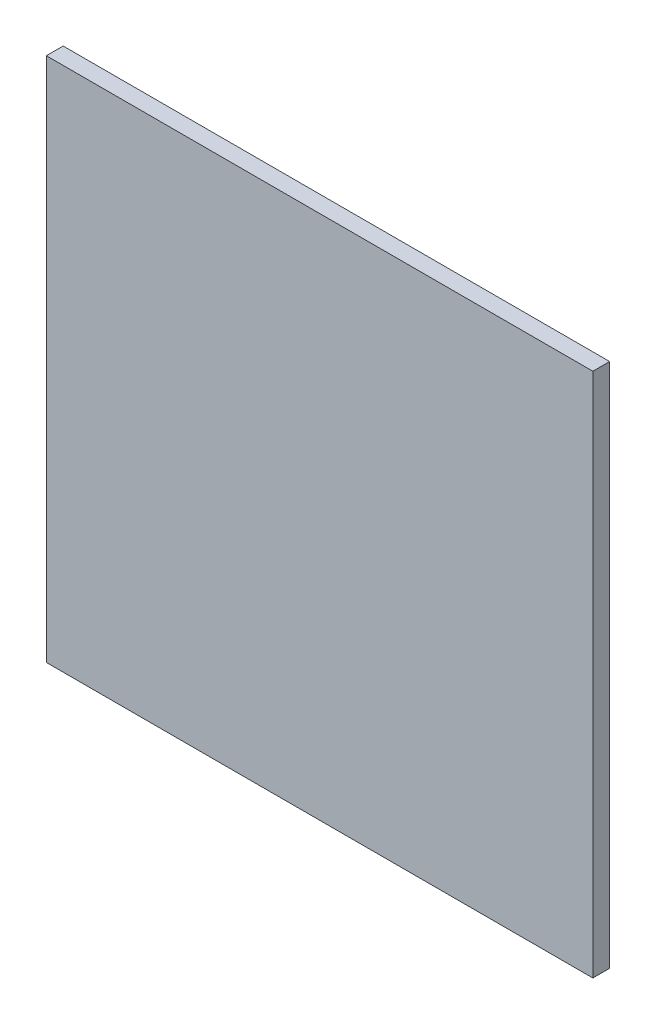
ISO-10303-21;
HEADER;
FILE_DESCRIPTION(('STEP AP214'),'2;1');
FILE_NAME('part.step','',(''),(''),'','','');
FILE_SCHEMA(('AUTOMOTIVE_DESIGN { 1 0 10303 214 1 1 1 1 }'));
ENDSEC;
DATA;
#1=APPLICATION_CONTEXT('core data for automotive mechanical design processes');
#2=APPLICATION_PROTOCOL_DEFINITION('international standard','automotive_design',2000,#1);
#3=PRODUCT_CONTEXT('',#1,'mechanical');
#4=PRODUCT('Part','Part','',(#3));
#5=PRODUCT_RELATED_PRODUCT_CATEGORY('part','',(#4));
#6=PRODUCT_DEFINITION_FORMATION('','',#4);
#7=PRODUCT_DEFINITION_CONTEXT('part definition',#1,'design');
#8=PRODUCT_DEFINITION('design','',#6,#7);
#9=PRODUCT_DEFINITION_SHAPE('','',#8);
#10=(LENGTH_UNIT() NAMED_UNIT(*) SI_UNIT(.MILLI.,.METRE.));
#11=(NAMED_UNIT(*) PLANE_ANGLE_UNIT() SI_UNIT($,.RADIAN.));
#12=(NAMED_UNIT(*) SI_UNIT($,.STERADIAN.) SOLID_ANGLE_UNIT());
#13=UNCERTAINTY_MEASURE_WITH_UNIT(LENGTH_MEASURE(1.E-05),#10,'distance_accuracy_value','');
#14=(GEOMETRIC_REPRESENTATION_CONTEXT(3) GLOBAL_UNCERTAINTY_ASSIGNED_CONTEXT((#13)) GLOBAL_UNIT_ASSIGNED_CONTEXT((#10,
#11,#12)) REPRESENTATION_CONTEXT('',''));
#15=CARTESIAN_POINT('',(0.,0.,0.));
#16=DIRECTION('',(0.,0.,1.));
#17=DIRECTION('',(1.,0.,0.));
#18=AXIS2_PLACEMENT_3D('',#15,#16,#17);
#19=CARTESIAN_POINT('',(0.,0.,0.65));
#20=DIRECTION('',(0.,0.,1.));
#21=DIRECTION('',(1.,0.,0.));
#22=AXIS2_PLACEMENT_3D('',#19,#20,#21);
#23=PLANE('',#22);
#24=DIRECTION('',(0.,1.,0.));
#25=VECTOR('',#24,1.);
#26=CARTESIAN_POINT('',(0.7,0.3125,0.65));
#27=LINE('',#26,#25);
#28=CARTESIAN_POINT('',(0.7,-0.625,0.65));
#29=VERTEX_POINT('',#28);
#30=CARTESIAN_POINT('',(0.7,0.625,0.65));
#31=VERTEX_POINT('',#30);
#32=EDGE_CURVE('E27',#29,#31,#27,.T.);
#33=ORIENTED_EDGE('',*,*,#32,.T.);
#34=DIRECTION('',(-1.,0.,0.));
#35=VECTOR('',#34,1.);
#36=CARTESIAN_POINT('',(1.,0.625,0.65));
#37=LINE('',#36,#35);
#38=CARTESIAN_POINT('',(-0.6,0.625,0.65));
#39=VERTEX_POINT('',#38);
#40=EDGE_CURVE('E20',#31,#39,#37,.T.);
#41=ORIENTED_EDGE('',*,*,#40,.T.);
#42=DIRECTION('',(0.,-1.,0.));
#43=VECTOR('',#42,1.);
#44=CARTESIAN_POINT('',(-0.6,0.3125,0.65));
#45=LINE('',#44,#43);
#46=CARTESIAN_POINT('',(-0.6,-0.625,0.65));
#47=VERTEX_POINT('',#46);
#48=EDGE_CURVE('E11',#39,#47,#45,.T.);
#49=ORIENTED_EDGE('',*,*,#48,.T.);
#50=DIRECTION('',(1.,0.,0.));
#51=VECTOR('',#50,1.);
#52=CARTESIAN_POINT('',(-1.,-0.625,0.65));
#53=LINE('',#52,#51);
#54=EDGE_CURVE('E63',#47,#29,#53,.T.);
#55=ORIENTED_EDGE('',*,*,#54,.T.);
#56=EDGE_LOOP('',(#33,#41,#49,#55));
#57=FACE_BOUND('',#56,.T.);
#58=ADVANCED_FACE('F16',(#57),#23,.T.);
#59=CARTESIAN_POINT('',(-0.6,0.625,0.61));
#60=DIRECTION('',(1.,0.,0.));
#61=DIRECTION('',(0.,1.,0.));
#62=AXIS2_PLACEMENT_3D('',#59,#60,#61);
#63=PLANE('',#62);
#64=DIRECTION('',(0.,0.,-1.));
#65=VECTOR('',#64,1.);
#66=CARTESIAN_POINT('',(-0.6,-0.625,0.305));
#67=LINE('',#66,#65);
#68=CARTESIAN_POINT('',(-0.6,-0.625,0.61));
#69=VERTEX_POINT('',#68);
#70=EDGE_CURVE('E70',#47,#69,#67,.T.);
#71=ORIENTED_EDGE('',*,*,#70,.F.);
#72=ORIENTED_EDGE('',*,*,#48,.F.);
#73=DIRECTION('',(0.,0.,1.));
#74=VECTOR('',#73,1.);
#75=CARTESIAN_POINT('',(-0.6,0.625,0.305));
#76=LINE('',#75,#74);
#77=CARTESIAN_POINT('',(-0.6,0.625,0.61));
#78=VERTEX_POINT('',#77);
#79=EDGE_CURVE('E78',#78,#39,#76,.T.);
#80=ORIENTED_EDGE('',*,*,#79,.F.);
#81=DIRECTION('',(0.,-1.,0.));
#82=VECTOR('',#81,1.);
#83=CARTESIAN_POINT('',(-0.6,0.625,0.61));
#84=LINE('',#83,#82);
#85=EDGE_CURVE('E73',#78,#69,#84,.T.);
#86=ORIENTED_EDGE('',*,*,#85,.T.);
#87=EDGE_LOOP('',(#71,#72,#80,#86));
#88=FACE_BOUND('',#87,.T.);
#89=ADVANCED_FACE('F71',(#88),#63,.F.);
#90=CARTESIAN_POINT('',(0.7,0.625,0.65));
#91=DIRECTION('',(-1.,0.,0.));
#92=DIRECTION('',(0.,0.,1.));
#93=AXIS2_PLACEMENT_3D('',#90,#91,#92);
#94=PLANE('',#93);
#95=DIRECTION('',(0.,0.,1.));
#96=VECTOR('',#95,1.);
#97=CARTESIAN_POINT('',(0.7,-0.625,0.325));
#98=LINE('',#97,#96);
#99=CARTESIAN_POINT('',(0.7,-0.625,0.61));
#100=VERTEX_POINT('',#99);
#101=EDGE_CURVE('E81',#100,#29,#98,.T.);
#102=ORIENTED_EDGE('',*,*,#101,.F.);
#103=DIRECTION('',(0.,-1.,0.));
#104=VECTOR('',#103,1.);
#105=CARTESIAN_POINT('',(0.7,0.625,0.61));
#106=LINE('',#105,#104);
#107=CARTESIAN_POINT('',(0.7,0.625,0.61));
#108=VERTEX_POINT('',#107);
#109=EDGE_CURVE('E96',#108,#100,#106,.T.);
#110=ORIENTED_EDGE('',*,*,#109,.F.);
#111=DIRECTION('',(0.,0.,-1.));
#112=VECTOR('',#111,1.);
#113=CARTESIAN_POINT('',(0.7,0.625,0.325));
#114=LINE('',#113,#112);
#115=EDGE_CURVE('E91',#31,#108,#114,.T.);
#116=ORIENTED_EDGE('',*,*,#115,.F.);
#117=ORIENTED_EDGE('',*,*,#32,.F.);
#118=EDGE_LOOP('',(#102,#110,#116,#117));
#119=FACE_BOUND('',#118,.T.);
#120=ADVANCED_FACE('F161',(#119),#94,.F.);
#121=CARTESIAN_POINT('',(1.,0.625,0.));
#122=DIRECTION('',(0.,1.,0.));
#123=DIRECTION('',(1.,0.,0.));
#124=AXIS2_PLACEMENT_3D('',#121,#122,#123);
#125=PLANE('',#124);
#126=DIRECTION('',(-1.,0.,0.));
#127=VECTOR('',#126,1.);
#128=CARTESIAN_POINT('',(0.992992685767,0.625,0.61));
#129=LINE('',#128,#127);
#130=EDGE_CURVE('E100',#108,#78,#129,.T.);
#131=ORIENTED_EDGE('',*,*,#130,.T.);
#132=ORIENTED_EDGE('',*,*,#79,.T.);
#133=ORIENTED_EDGE('',*,*,#40,.F.);
#134=ORIENTED_EDGE('',*,*,#115,.T.);
#135=EDGE_LOOP('',(#131,#132,#133,#134));
#136=FACE_BOUND('',#135,.T.);
#137=ADVANCED_FACE('F150',(#136),#125,.T.);
#138=CARTESIAN_POINT('',(-1.,-0.625,0.));
#139=DIRECTION('',(0.,-1.,0.));
#140=DIRECTION('',(0.,0.,-1.));
#141=AXIS2_PLACEMENT_3D('',#138,#139,#140);
#142=PLANE('',#141);
#143=DIRECTION('',(1.,0.,0.));
#144=VECTOR('',#143,1.);
#145=CARTESIAN_POINT('',(-0.007007314232531,-0.625,0.61));
#146=LINE('',#145,#144);
#147=EDGE_CURVE('E99',#69,#100,#146,.T.);
#148=ORIENTED_EDGE('',*,*,#147,.T.);
#149=ORIENTED_EDGE('',*,*,#101,.T.);
#150=ORIENTED_EDGE('',*,*,#54,.F.);
#151=ORIENTED_EDGE('',*,*,#70,.T.);
#152=EDGE_LOOP('',(#148,#149,#150,#151));
#153=FACE_BOUND('',#152,.T.);
#154=ADVANCED_FACE('F80',(#153),#142,.T.);
#155=CARTESIAN_POINT('',(0.985985371535,-0.625,0.61));
#156=DIRECTION('',(0.,0.,1.));
#157=DIRECTION('',(1.,0.,0.));
#158=AXIS2_PLACEMENT_3D('',#155,#156,#157);
#159=PLANE('',#158);
#160=ORIENTED_EDGE('',*,*,#130,.F.);
#161=ORIENTED_EDGE('',*,*,#109,.T.);
#162=ORIENTED_EDGE('',*,*,#147,.F.);
#163=ORIENTED_EDGE('',*,*,#85,.F.);
#164=EDGE_LOOP('',(#160,#161,#162,#163));
#165=FACE_BOUND('',#164,.T.);
#166=ADVANCED_FACE('F18',(#165),#159,.F.);
#167=CLOSED_SHELL('',(#58,#89,#120,#137,#154,#166));
#168=MANIFOLD_SOLID_BREP('B1',#167);
#169=ADVANCED_BREP_SHAPE_REPRESENTATION('',(#18,#168),#14);
#170=SHAPE_DEFINITION_REPRESENTATION(#9,#169);
ENDSEC;
END-ISO-10303-21;
